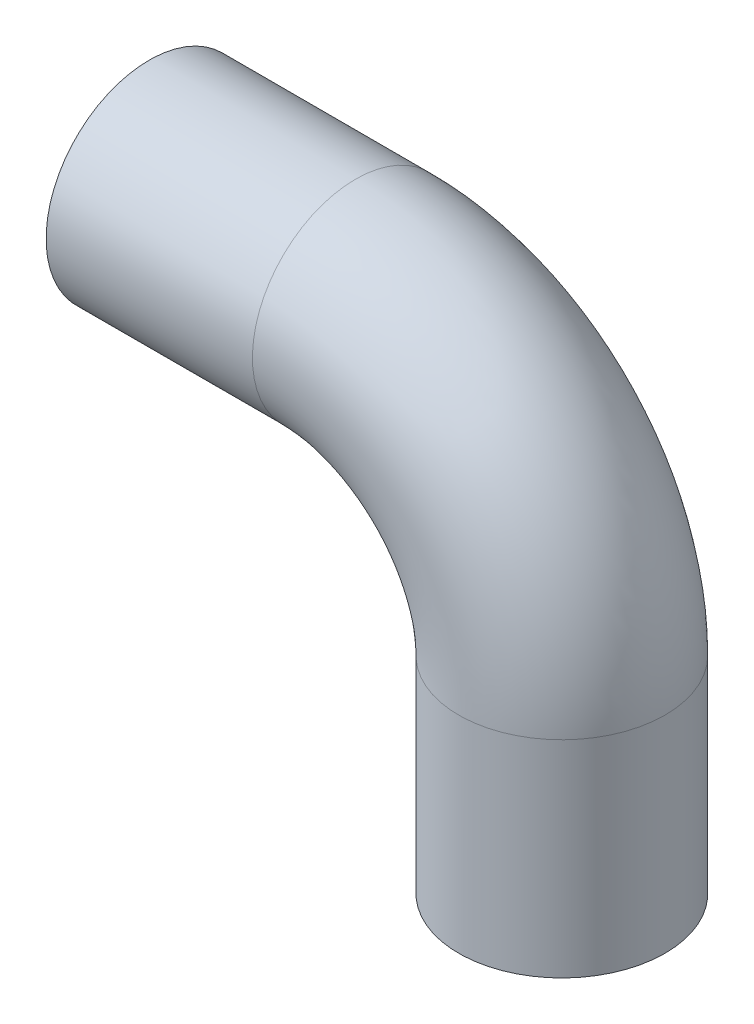
ISO-10303-21;
HEADER;
FILE_DESCRIPTION(('STEP AP214'),'2;1');
FILE_NAME('part.step','',(''),(''),'','','');
FILE_SCHEMA(('AUTOMOTIVE_DESIGN { 1 0 10303 214 1 1 1 1 }'));
ENDSEC;
DATA;
#1=APPLICATION_CONTEXT('core data for automotive mechanical design processes');
#2=APPLICATION_PROTOCOL_DEFINITION('international standard','automotive_design',2000,#1);
#3=PRODUCT_CONTEXT('',#1,'mechanical');
#4=PRODUCT('Part','Part','',(#3));
#5=PRODUCT_RELATED_PRODUCT_CATEGORY('part','',(#4));
#6=PRODUCT_DEFINITION_FORMATION('','',#4);
#7=PRODUCT_DEFINITION_CONTEXT('part definition',#1,'design');
#8=PRODUCT_DEFINITION('design','',#6,#7);
#9=PRODUCT_DEFINITION_SHAPE('','',#8);
#10=(LENGTH_UNIT() NAMED_UNIT(*) SI_UNIT(.MILLI.,.METRE.));
#11=(NAMED_UNIT(*) PLANE_ANGLE_UNIT() SI_UNIT($,.RADIAN.));
#12=(NAMED_UNIT(*) SI_UNIT($,.STERADIAN.) SOLID_ANGLE_UNIT());
#13=UNCERTAINTY_MEASURE_WITH_UNIT(LENGTH_MEASURE(1.E-05),#10,'distance_accuracy_value','');
#14=(GEOMETRIC_REPRESENTATION_CONTEXT(3) GLOBAL_UNCERTAINTY_ASSIGNED_CONTEXT((#13)) GLOBAL_UNIT_ASSIGNED_CONTEXT((#10,
#11,#12)) REPRESENTATION_CONTEXT('',''));
#15=CARTESIAN_POINT('',(0.,0.,0.));
#16=DIRECTION('',(0.,0.,1.));
#17=DIRECTION('',(1.,0.,0.));
#18=AXIS2_PLACEMENT_3D('',#15,#16,#17);
#19=CARTESIAN_POINT('',(0.,0.,0.));
#20=DIRECTION('',(1.,0.,0.));
#21=DIRECTION('',(0.,0.,-1.));
#22=AXIS2_PLACEMENT_3D('',#19,#20,#21);
#23=PLANE('',#22);
#24=CARTESIAN_POINT('',(0.,0.,0.));
#25=DIRECTION('',(1.,0.,0.));
#26=DIRECTION('',(0.,0.,-1.));
#27=AXIS2_PLACEMENT_3D('',#24,#25,#26);
#28=CIRCLE('',#27,5.);
#29=CARTESIAN_POINT('',(0.,0.,-5.));
#30=VERTEX_POINT('',#29);
#31=EDGE_CURVE('E47',#30,#30,#28,.T.);
#32=ORIENTED_EDGE('',*,*,#31,.F.);
#33=EDGE_LOOP('',(#32));
#34=FACE_BOUND('',#33,.T.);
#35=ADVANCED_FACE('F35',(#34),#23,.F.);
#36=CARTESIAN_POINT('',(20.,-20.,0.));
#37=DIRECTION('',(0.,-1.,0.));
#38=DIRECTION('',(0.,0.,-1.));
#39=AXIS2_PLACEMENT_3D('',#36,#37,#38);
#40=PLANE('',#39);
#41=CARTESIAN_POINT('',(20.,-20.,0.));
#42=DIRECTION('',(0.,-1.,0.));
#43=DIRECTION('',(0.,0.,-1.));
#44=AXIS2_PLACEMENT_3D('',#41,#42,#43);
#45=CIRCLE('',#44,5.);
#46=CARTESIAN_POINT('',(20.,-20.,-5.));
#47=VERTEX_POINT('',#46);
#48=EDGE_CURVE('E11',#47,#47,#45,.T.);
#49=ORIENTED_EDGE('',*,*,#48,.T.);
#50=EDGE_LOOP('',(#49));
#51=FACE_BOUND('',#50,.T.);
#52=ADVANCED_FACE('F50',(#51),#40,.T.);
#53=CARTESIAN_POINT('',(0.,0.,0.));
#54=DIRECTION('',(1.,0.,0.));
#55=DIRECTION('',(0.,0.,-1.));
#56=AXIS2_PLACEMENT_3D('',#53,#54,#55);
#57=CYLINDRICAL_SURFACE('',#56,5.);
#58=CARTESIAN_POINT('',(10.,0.,0.));
#59=DIRECTION('',(1.,0.,0.));
#60=DIRECTION('',(0.,0.,-1.));
#61=AXIS2_PLACEMENT_3D('',#58,#59,#60);
#62=CIRCLE('',#61,5.);
#63=CARTESIAN_POINT('',(10.,5.,0.));
#64=VERTEX_POINT('',#63);
#65=EDGE_CURVE('E60',#64,#64,#62,.T.);
#66=ORIENTED_EDGE('',*,*,#65,.F.);
#67=EDGE_LOOP('',(#66));
#68=FACE_BOUND('',#67,.T.);
#69=ORIENTED_EDGE('',*,*,#31,.T.);
#70=EDGE_LOOP('',(#69));
#71=FACE_BOUND('',#70,.T.);
#72=ADVANCED_FACE('F65',(#68,#71),#57,.T.);
#73=CARTESIAN_POINT('',(10.,-10.,0.));
#74=DIRECTION('',(0.,0.,-1.));
#75=DIRECTION('',(-1.,0.,0.));
#76=AXIS2_PLACEMENT_3D('',#73,#74,#75);
#77=TOROIDAL_SURFACE('',#76,10.,5.);
#78=CARTESIAN_POINT('',(20.,-10.,0.));
#79=DIRECTION('',(0.,-1.,0.));
#80=DIRECTION('',(0.,0.,-1.));
#81=AXIS2_PLACEMENT_3D('',#78,#79,#80);
#82=CIRCLE('',#81,5.);
#83=CARTESIAN_POINT('',(25.,-10.,0.));
#84=VERTEX_POINT('',#83);
#85=EDGE_CURVE('E42',#84,#84,#82,.T.);
#86=CARTESIAN_POINT('',(10.,-10.,0.));
#87=DIRECTION('',(0.,0.,-1.));
#88=DIRECTION('',(-1.,0.,0.));
#89=AXIS2_PLACEMENT_3D('',#86,#87,#88);
#90=CIRCLE('',#89,15.);
#91=EDGE_CURVE('',#64,#84,#90,.T.);
#92=ORIENTED_EDGE('',*,*,#65,.T.);
#93=ORIENTED_EDGE('',*,*,#85,.F.);
#94=ORIENTED_EDGE('',*,*,#91,.T.);
#95=ORIENTED_EDGE('',*,*,#91,.F.);
#96=EDGE_LOOP('',(#92,#94,#93,#95));
#97=FACE_BOUND('',#96,.T.);
#98=ADVANCED_FACE('F55',(#97),#77,.T.);
#99=CARTESIAN_POINT('',(20.,-10.,0.));
#100=DIRECTION('',(0.,-1.,0.));
#101=DIRECTION('',(1.,0.,0.));
#102=AXIS2_PLACEMENT_3D('',#99,#100,#101);
#103=CYLINDRICAL_SURFACE('',#102,5.);
#104=ORIENTED_EDGE('',*,*,#48,.F.);
#105=EDGE_LOOP('',(#104));
#106=FACE_BOUND('',#105,.T.);
#107=ORIENTED_EDGE('',*,*,#85,.T.);
#108=EDGE_LOOP('',(#107));
#109=FACE_BOUND('',#108,.T.);
#110=ADVANCED_FACE('F52',(#106,#109),#103,.T.);
#111=CLOSED_SHELL('',(#35,#52,#72,#98,#110));
#112=MANIFOLD_SOLID_BREP('B2',#111);
#113=ADVANCED_BREP_SHAPE_REPRESENTATION('',(#18,#112),#14);
#114=SHAPE_DEFINITION_REPRESENTATION(#9,#113);
ENDSEC;
END-ISO-10303-21;
